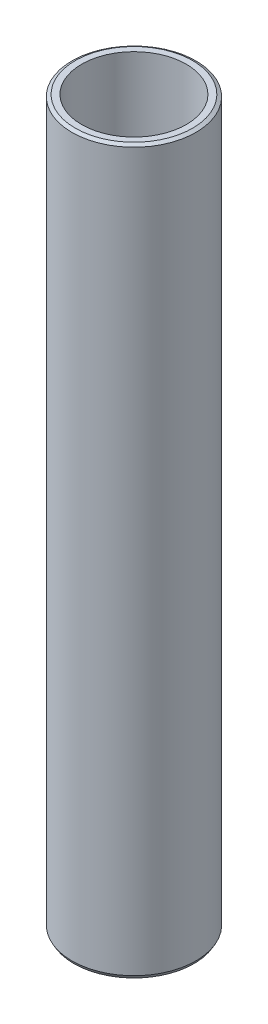
ISO-10303-21;
HEADER;
FILE_DESCRIPTION(('STEP AP214'),'2;1');
FILE_NAME('part.step','',(''),(''),'','','');
FILE_SCHEMA(('AUTOMOTIVE_DESIGN { 1 0 10303 214 1 1 1 1 }'));
ENDSEC;
DATA;
#1=APPLICATION_CONTEXT('core data for automotive mechanical design processes');
#2=APPLICATION_PROTOCOL_DEFINITION('international standard','automotive_design',2000,#1);
#3=PRODUCT_CONTEXT('',#1,'mechanical');
#4=PRODUCT('Part','Part','',(#3));
#5=PRODUCT_RELATED_PRODUCT_CATEGORY('part','',(#4));
#6=PRODUCT_DEFINITION_FORMATION('','',#4);
#7=PRODUCT_DEFINITION_CONTEXT('part definition',#1,'design');
#8=PRODUCT_DEFINITION('design','',#6,#7);
#9=PRODUCT_DEFINITION_SHAPE('','',#8);
#10=(LENGTH_UNIT() NAMED_UNIT(*) SI_UNIT(.MILLI.,.METRE.));
#11=(NAMED_UNIT(*) PLANE_ANGLE_UNIT() SI_UNIT($,.RADIAN.));
#12=(NAMED_UNIT(*) SI_UNIT($,.STERADIAN.) SOLID_ANGLE_UNIT());
#13=UNCERTAINTY_MEASURE_WITH_UNIT(LENGTH_MEASURE(1.E-05),#10,'distance_accuracy_value','');
#14=(GEOMETRIC_REPRESENTATION_CONTEXT(3) GLOBAL_UNCERTAINTY_ASSIGNED_CONTEXT((#13)) GLOBAL_UNIT_ASSIGNED_CONTEXT((#10,
#11,#12)) REPRESENTATION_CONTEXT('',''));
#15=CARTESIAN_POINT('',(0.,0.,0.));
#16=DIRECTION('',(0.,0.,1.));
#17=DIRECTION('',(1.,0.,0.));
#18=AXIS2_PLACEMENT_3D('',#15,#16,#17);
#19=CARTESIAN_POINT('',(0.,466.259949835471,0.));
#20=DIRECTION('',(0.,-1.,0.));
#21=DIRECTION('',(0.,0.,-1.));
#22=AXIS2_PLACEMENT_3D('',#19,#20,#21);
#23=CYLINDRICAL_SURFACE('',#22,40.);
#24=CARTESIAN_POINT('',(0.,465.002737444671,0.));
#25=DIRECTION('',(0.,1.,0.));
#26=DIRECTION('',(0.,0.,1.));
#27=AXIS2_PLACEMENT_3D('',#24,#25,#26);
#28=CIRCLE('',#27,40.);
#29=CARTESIAN_POINT('',(0.,465.002737444671,40.));
#30=VERTEX_POINT('',#29);
#31=EDGE_CURVE('E50',#30,#30,#28,.F.);
#32=ORIENTED_EDGE('',*,*,#31,.T.);
#33=EDGE_LOOP('',(#32));
#34=FACE_BOUND('',#33,.T.);
#35=CARTESIAN_POINT('',(0.,2.17755573677159,0.));
#36=DIRECTION('',(0.,1.,0.));
#37=DIRECTION('',(0.,0.,1.));
#38=AXIS2_PLACEMENT_3D('',#35,#36,#37);
#39=CIRCLE('',#38,40.);
#40=CARTESIAN_POINT('',(0.,2.17755573677159,40.));
#41=VERTEX_POINT('',#40);
#42=EDGE_CURVE('E51',#41,#41,#39,.T.);
#43=ORIENTED_EDGE('',*,*,#42,.T.);
#44=EDGE_LOOP('',(#43));
#45=FACE_BOUND('',#44,.T.);
#46=ADVANCED_FACE('F39',(#34,#45),#23,.T.);
#47=CARTESIAN_POINT('',(0.,466.259949835471,0.));
#48=DIRECTION('',(0.,1.,0.));
#49=DIRECTION('',(0.,0.,1.));
#50=AXIS2_PLACEMENT_3D('',#47,#48,#49);
#51=PLANE('',#50);
#52=CARTESIAN_POINT('',(0.,466.259949835471,0.));
#53=DIRECTION('',(0.,1.,0.));
#54=DIRECTION('',(0.,0.,1.));
#55=AXIS2_PLACEMENT_3D('',#52,#53,#54);
#56=CIRCLE('',#55,37.8224442632284);
#57=CARTESIAN_POINT('',(0.,466.259949835471,37.8224442632284));
#58=VERTEX_POINT('',#57);
#59=EDGE_CURVE('E54',#58,#58,#56,.T.);
#60=ORIENTED_EDGE('',*,*,#59,.T.);
#61=EDGE_LOOP('',(#60));
#62=FACE_BOUND('',#61,.T.);
#63=CARTESIAN_POINT('',(0.,466.259949835471,0.));
#64=DIRECTION('',(0.,1.,0.));
#65=DIRECTION('',(0.,0.,1.));
#66=AXIS2_PLACEMENT_3D('',#63,#64,#65);
#67=CIRCLE('',#66,33.7626774359858);
#68=CARTESIAN_POINT('',(0.,466.259949835471,33.7626774359858));
#69=VERTEX_POINT('',#68);
#70=EDGE_CURVE('E58',#69,#69,#67,.T.);
#71=ORIENTED_EDGE('',*,*,#70,.F.);
#72=EDGE_LOOP('',(#71));
#73=FACE_BOUND('',#72,.T.);
#74=ADVANCED_FACE('F69',(#62,#73),#51,.T.);
#75=CARTESIAN_POINT('',(0.,0.,0.));
#76=DIRECTION('',(0.,1.,0.));
#77=DIRECTION('',(0.,0.,1.));
#78=AXIS2_PLACEMENT_3D('',#75,#76,#77);
#79=PLANE('',#78);
#80=CARTESIAN_POINT('',(0.,0.,0.));
#81=DIRECTION('',(0.,1.,0.));
#82=DIRECTION('',(0.,0.,1.));
#83=AXIS2_PLACEMENT_3D('',#80,#81,#82);
#84=CIRCLE('',#83,38.7427876091995);
#85=CARTESIAN_POINT('',(0.,0.,38.7427876091995));
#86=VERTEX_POINT('',#85);
#87=EDGE_CURVE('E10',#86,#86,#84,.F.);
#88=ORIENTED_EDGE('',*,*,#87,.T.);
#89=EDGE_LOOP('',(#88));
#90=FACE_BOUND('',#89,.T.);
#91=CARTESIAN_POINT('',(0.,0.,0.));
#92=DIRECTION('',(0.,1.,0.));
#93=DIRECTION('',(0.,0.,1.));
#94=AXIS2_PLACEMENT_3D('',#91,#92,#93);
#95=CIRCLE('',#94,33.7626774359858);
#96=CARTESIAN_POINT('',(0.,0.,33.7626774359858));
#97=VERTEX_POINT('',#96);
#98=EDGE_CURVE('E63',#97,#97,#95,.T.);
#99=ORIENTED_EDGE('',*,*,#98,.T.);
#100=EDGE_LOOP('',(#99));
#101=FACE_BOUND('',#100,.T.);
#102=ADVANCED_FACE('F75',(#90,#101),#79,.F.);
#103=CARTESIAN_POINT('',(0.,466.259949835471,0.));
#104=DIRECTION('',(0.,-1.,0.));
#105=DIRECTION('',(0.,0.,-1.));
#106=AXIS2_PLACEMENT_3D('',#103,#104,#105);
#107=CYLINDRICAL_SURFACE('',#106,33.7626774359858);
#108=ORIENTED_EDGE('',*,*,#70,.T.);
#109=EDGE_LOOP('',(#108));
#110=FACE_BOUND('',#109,.T.);
#111=ORIENTED_EDGE('',*,*,#98,.F.);
#112=EDGE_LOOP('',(#111));
#113=FACE_BOUND('',#112,.T.);
#114=ADVANCED_FACE('F70',(#110,#113),#107,.F.);
#115=CARTESIAN_POINT('',(0.,466.259949835471,0.));
#116=DIRECTION('',(0.,-1.,0.));
#117=DIRECTION('',(0.,0.,-1.));
#118=AXIS2_PLACEMENT_3D('',#115,#116,#117);
#119=CONICAL_SURFACE('',#118,37.8224442632284,1.04719755119658);
#120=ORIENTED_EDGE('',*,*,#31,.F.);
#121=EDGE_LOOP('',(#120));
#122=FACE_BOUND('',#121,.T.);
#123=ORIENTED_EDGE('',*,*,#59,.F.);
#124=EDGE_LOOP('',(#123));
#125=FACE_BOUND('',#124,.T.);
#126=ADVANCED_FACE('F81',(#122,#125),#119,.T.);
#127=CARTESIAN_POINT('',(0.,2.17755573677159,0.));
#128=DIRECTION('',(0.,1.,0.));
#129=DIRECTION('',(0.,0.,1.));
#130=AXIS2_PLACEMENT_3D('',#127,#128,#129);
#131=CONICAL_SURFACE('',#130,40.,0.523598775598304);
#132=ORIENTED_EDGE('',*,*,#87,.F.);
#133=EDGE_LOOP('',(#132));
#134=FACE_BOUND('',#133,.T.);
#135=ORIENTED_EDGE('',*,*,#42,.F.);
#136=EDGE_LOOP('',(#135));
#137=FACE_BOUND('',#136,.T.);
#138=ADVANCED_FACE('F45',(#134,#137),#131,.T.);
#139=CLOSED_SHELL('',(#46,#74,#102,#114,#126,#138));
#140=MANIFOLD_SOLID_BREP('B2',#139);
#141=ADVANCED_BREP_SHAPE_REPRESENTATION('',(#18,#140),#14);
#142=SHAPE_DEFINITION_REPRESENTATION(#9,#141);
ENDSEC;
END-ISO-10303-21;
